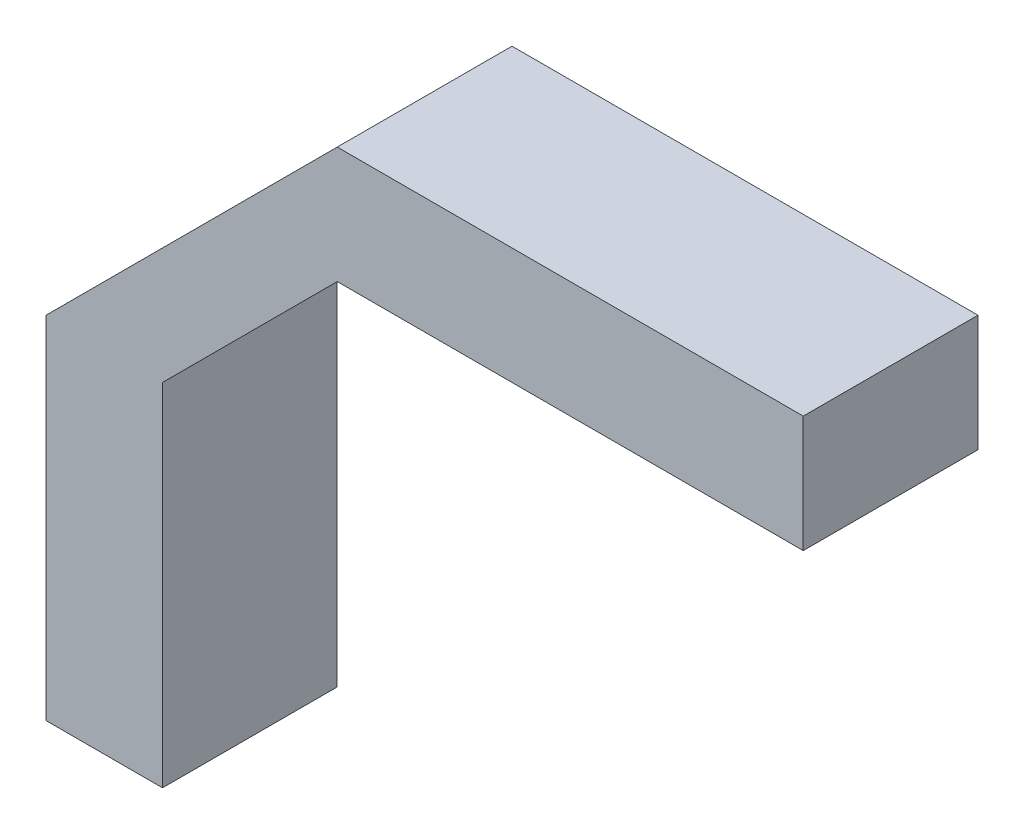
ISO-10303-21;
HEADER;
FILE_DESCRIPTION(('STEP AP214'),'2;1');
FILE_NAME('part.step','',(''),(''),'','','');
FILE_SCHEMA(('AUTOMOTIVE_DESIGN { 1 0 10303 214 1 1 1 1 }'));
ENDSEC;
DATA;
#1=APPLICATION_CONTEXT('core data for automotive mechanical design processes');
#2=APPLICATION_PROTOCOL_DEFINITION('international standard','automotive_design',2000,#1);
#3=PRODUCT_CONTEXT('',#1,'mechanical');
#4=PRODUCT('Part','Part','',(#3));
#5=PRODUCT_RELATED_PRODUCT_CATEGORY('part','',(#4));
#6=PRODUCT_DEFINITION_FORMATION('','',#4);
#7=PRODUCT_DEFINITION_CONTEXT('part definition',#1,'design');
#8=PRODUCT_DEFINITION('design','',#6,#7);
#9=PRODUCT_DEFINITION_SHAPE('','',#8);
#10=(LENGTH_UNIT() NAMED_UNIT(*) SI_UNIT(.MILLI.,.METRE.));
#11=(NAMED_UNIT(*) PLANE_ANGLE_UNIT() SI_UNIT($,.RADIAN.));
#12=(NAMED_UNIT(*) SI_UNIT($,.STERADIAN.) SOLID_ANGLE_UNIT());
#13=UNCERTAINTY_MEASURE_WITH_UNIT(LENGTH_MEASURE(1.E-05),#10,'distance_accuracy_value','');
#14=(GEOMETRIC_REPRESENTATION_CONTEXT(3) GLOBAL_UNCERTAINTY_ASSIGNED_CONTEXT((#13)) GLOBAL_UNIT_ASSIGNED_CONTEXT((#10,
#11,#12)) REPRESENTATION_CONTEXT('',''));
#15=CARTESIAN_POINT('',(0.,0.,0.));
#16=DIRECTION('',(0.,0.,1.));
#17=DIRECTION('',(1.,0.,0.));
#18=AXIS2_PLACEMENT_3D('',#15,#16,#17);
#19=CARTESIAN_POINT('',(0.,0.,7.5));
#20=DIRECTION('',(1.,0.,0.));
#21=DIRECTION('',(0.,1.,0.));
#22=AXIS2_PLACEMENT_3D('',#19,#20,#21);
#23=PLANE('',#22);
#24=DIRECTION('',(0.,-1.,0.));
#25=VECTOR('',#24,1.);
#26=CARTESIAN_POINT('',(0.,0.,-7.5));
#27=LINE('',#26,#25);
#28=CARTESIAN_POINT('',(0.,30.1334651507662,-7.5));
#29=VERTEX_POINT('',#28);
#30=CARTESIAN_POINT('',(0.,0.,-7.5));
#31=VERTEX_POINT('',#30);
#32=EDGE_CURVE('E128',#29,#31,#27,.T.);
#33=ORIENTED_EDGE('',*,*,#32,.T.);
#34=DIRECTION('',(0.,0.,-1.));
#35=VECTOR('',#34,1.);
#36=CARTESIAN_POINT('',(0.,0.,7.5));
#37=LINE('',#36,#35);
#38=CARTESIAN_POINT('',(0.,0.,7.5));
#39=VERTEX_POINT('',#38);
#40=EDGE_CURVE('E11',#39,#31,#37,.T.);
#41=ORIENTED_EDGE('',*,*,#40,.F.);
#42=DIRECTION('',(0.,-1.,0.));
#43=VECTOR('',#42,1.);
#44=CARTESIAN_POINT('',(0.,0.,7.5));
#45=LINE('',#44,#43);
#46=CARTESIAN_POINT('',(0.,30.1334651507662,7.5));
#47=VERTEX_POINT('',#46);
#48=EDGE_CURVE('E142',#47,#39,#45,.T.);
#49=ORIENTED_EDGE('',*,*,#48,.F.);
#50=DIRECTION('',(0.,0.,-1.));
#51=VECTOR('',#50,1.);
#52=CARTESIAN_POINT('',(0.,30.1334651507662,7.5));
#53=LINE('',#52,#51);
#54=EDGE_CURVE('E124',#47,#29,#53,.T.);
#55=ORIENTED_EDGE('',*,*,#54,.T.);
#56=EDGE_LOOP('',(#33,#41,#49,#55));
#57=FACE_BOUND('',#56,.T.);
#58=ADVANCED_FACE('F32',(#57),#23,.F.);
#59=CARTESIAN_POINT('',(0.,0.,7.5));
#60=DIRECTION('',(0.,1.,0.));
#61=DIRECTION('',(0.,0.,1.));
#62=AXIS2_PLACEMENT_3D('',#59,#60,#61);
#63=PLANE('',#62);
#64=DIRECTION('',(1.,0.,0.));
#65=VECTOR('',#64,1.);
#66=CARTESIAN_POINT('',(0.,0.,-7.5));
#67=LINE('',#66,#65);
#68=CARTESIAN_POINT('',(10.,0.,-7.5));
#69=VERTEX_POINT('',#68);
#70=EDGE_CURVE('E131',#31,#69,#67,.T.);
#71=ORIENTED_EDGE('',*,*,#70,.T.);
#72=DIRECTION('',(0.,0.,-1.));
#73=VECTOR('',#72,1.);
#74=CARTESIAN_POINT('',(10.,0.,7.5));
#75=LINE('',#74,#73);
#76=CARTESIAN_POINT('',(10.,0.,7.5));
#77=VERTEX_POINT('',#76);
#78=EDGE_CURVE('E40',#77,#69,#75,.T.);
#79=ORIENTED_EDGE('',*,*,#78,.F.);
#80=DIRECTION('',(1.,0.,0.));
#81=VECTOR('',#80,1.);
#82=CARTESIAN_POINT('',(0.,0.,7.5));
#83=LINE('',#82,#81);
#84=EDGE_CURVE('E91',#39,#77,#83,.T.);
#85=ORIENTED_EDGE('',*,*,#84,.F.);
#86=ORIENTED_EDGE('',*,*,#40,.T.);
#87=EDGE_LOOP('',(#71,#79,#85,#86));
#88=FACE_BOUND('',#87,.T.);
#89=ADVANCED_FACE('F177',(#88),#63,.F.);
#90=CARTESIAN_POINT('',(10.,0.,7.5));
#91=DIRECTION('',(-1.,0.,0.));
#92=DIRECTION('',(0.,0.,1.));
#93=AXIS2_PLACEMENT_3D('',#90,#91,#92);
#94=PLANE('',#93);
#95=DIRECTION('',(0.,1.,0.));
#96=VECTOR('',#95,1.);
#97=CARTESIAN_POINT('',(10.,0.,-7.5));
#98=LINE('',#97,#96);
#99=CARTESIAN_POINT('',(10.,30.1334651507662,-7.5));
#100=VERTEX_POINT('',#99);
#101=EDGE_CURVE('E133',#69,#100,#98,.T.);
#102=ORIENTED_EDGE('',*,*,#101,.T.);
#103=DIRECTION('',(0.,0.,-1.));
#104=VECTOR('',#103,1.);
#105=CARTESIAN_POINT('',(10.,30.1334651507662,7.5));
#106=LINE('',#105,#104);
#107=CARTESIAN_POINT('',(10.,30.1334651507662,7.5));
#108=VERTEX_POINT('',#107);
#109=EDGE_CURVE('E149',#108,#100,#106,.T.);
#110=ORIENTED_EDGE('',*,*,#109,.F.);
#111=DIRECTION('',(0.,1.,0.));
#112=VECTOR('',#111,1.);
#113=CARTESIAN_POINT('',(10.,0.,7.5));
#114=LINE('',#113,#112);
#115=EDGE_CURVE('E157',#77,#108,#114,.T.);
#116=ORIENTED_EDGE('',*,*,#115,.F.);
#117=ORIENTED_EDGE('',*,*,#78,.T.);
#118=EDGE_LOOP('',(#102,#110,#116,#117));
#119=FACE_BOUND('',#118,.T.);
#120=ADVANCED_FACE('F155',(#119),#94,.F.);
#121=CARTESIAN_POINT('',(10.,30.1334651507662,7.5));
#122=DIRECTION('',(-0.707106781186547,0.707106781186548,0.));
#123=DIRECTION('',(-0.707106781186548,-0.707106781186547,0.));
#124=AXIS2_PLACEMENT_3D('',#121,#122,#123);
#125=PLANE('',#124);
#126=DIRECTION('',(0.707106781186548,0.707106781186547,0.));
#127=VECTOR('',#126,1.);
#128=CARTESIAN_POINT('',(10.,30.1334651507662,-7.5));
#129=LINE('',#128,#127);
#130=CARTESIAN_POINT('',(25.,45.1334651507662,-7.5));
#131=VERTEX_POINT('',#130);
#132=EDGE_CURVE('E135',#100,#131,#129,.T.);
#133=ORIENTED_EDGE('',*,*,#132,.T.);
#134=DIRECTION('',(0.,0.,-1.));
#135=VECTOR('',#134,1.);
#136=CARTESIAN_POINT('',(25.,45.1334651507662,7.5));
#137=LINE('',#136,#135);
#138=CARTESIAN_POINT('',(25.,45.1334651507662,7.5));
#139=VERTEX_POINT('',#138);
#140=EDGE_CURVE('E146',#139,#131,#137,.T.);
#141=ORIENTED_EDGE('',*,*,#140,.F.);
#142=DIRECTION('',(0.707106781186548,0.707106781186547,0.));
#143=VECTOR('',#142,1.);
#144=CARTESIAN_POINT('',(10.,30.1334651507662,7.5));
#145=LINE('',#144,#143);
#146=EDGE_CURVE('E169',#108,#139,#145,.T.);
#147=ORIENTED_EDGE('',*,*,#146,.F.);
#148=ORIENTED_EDGE('',*,*,#109,.T.);
#149=EDGE_LOOP('',(#133,#141,#147,#148));
#150=FACE_BOUND('',#149,.T.);
#151=ADVANCED_FACE('F165',(#150),#125,.F.);
#152=CARTESIAN_POINT('',(25.,45.1334651507662,7.5));
#153=DIRECTION('',(0.,1.,0.));
#154=DIRECTION('',(-1.,0.,0.));
#155=AXIS2_PLACEMENT_3D('',#152,#153,#154);
#156=PLANE('',#155);
#157=DIRECTION('',(1.,0.,0.));
#158=VECTOR('',#157,1.);
#159=CARTESIAN_POINT('',(25.,45.1334651507662,-7.5));
#160=LINE('',#159,#158);
#161=CARTESIAN_POINT('',(65.0000000000006,45.1334651507662,-7.5));
#162=VERTEX_POINT('',#161);
#163=EDGE_CURVE('E137',#131,#162,#160,.T.);
#164=ORIENTED_EDGE('',*,*,#163,.T.);
#165=DIRECTION('',(0.,0.,-1.));
#166=VECTOR('',#165,1.);
#167=CARTESIAN_POINT('',(65.0000000000006,45.1334651507662,7.5));
#168=LINE('',#167,#166);
#169=CARTESIAN_POINT('',(65.0000000000006,45.1334651507662,7.5));
#170=VERTEX_POINT('',#169);
#171=EDGE_CURVE('E119',#170,#162,#168,.T.);
#172=ORIENTED_EDGE('',*,*,#171,.F.);
#173=DIRECTION('',(1.,0.,0.));
#174=VECTOR('',#173,1.);
#175=CARTESIAN_POINT('',(25.,45.1334651507662,7.5));
#176=LINE('',#175,#174);
#177=EDGE_CURVE('E110',#139,#170,#176,.T.);
#178=ORIENTED_EDGE('',*,*,#177,.F.);
#179=ORIENTED_EDGE('',*,*,#140,.T.);
#180=EDGE_LOOP('',(#164,#172,#178,#179));
#181=FACE_BOUND('',#180,.T.);
#182=ADVANCED_FACE('F168',(#181),#156,.F.);
#183=CARTESIAN_POINT('',(65.0000000000006,55.1334651507662,7.5));
#184=DIRECTION('',(-1.,0.,0.));
#185=DIRECTION('',(0.,0.,1.));
#186=AXIS2_PLACEMENT_3D('',#183,#184,#185);
#187=PLANE('',#186);
#188=DIRECTION('',(0.,1.,0.));
#189=VECTOR('',#188,1.);
#190=CARTESIAN_POINT('',(65.0000000000006,55.1334651507662,-7.5));
#191=LINE('',#190,#189);
#192=CARTESIAN_POINT('',(65.0000000000006,55.1334651507662,-7.5));
#193=VERTEX_POINT('',#192);
#194=EDGE_CURVE('E118',#162,#193,#191,.T.);
#195=ORIENTED_EDGE('',*,*,#194,.T.);
#196=DIRECTION('',(0.,0.,-1.));
#197=VECTOR('',#196,1.);
#198=CARTESIAN_POINT('',(65.0000000000006,55.1334651507662,7.5));
#199=LINE('',#198,#197);
#200=CARTESIAN_POINT('',(65.0000000000006,55.1334651507662,7.5));
#201=VERTEX_POINT('',#200);
#202=EDGE_CURVE('E115',#201,#193,#199,.T.);
#203=ORIENTED_EDGE('',*,*,#202,.F.);
#204=DIRECTION('',(0.,1.,0.));
#205=VECTOR('',#204,1.);
#206=CARTESIAN_POINT('',(65.0000000000006,55.1334651507662,7.5));
#207=LINE('',#206,#205);
#208=EDGE_CURVE('E104',#170,#201,#207,.T.);
#209=ORIENTED_EDGE('',*,*,#208,.F.);
#210=ORIENTED_EDGE('',*,*,#171,.T.);
#211=EDGE_LOOP('',(#195,#203,#209,#210));
#212=FACE_BOUND('',#211,.T.);
#213=ADVANCED_FACE('F116',(#212),#187,.F.);
#214=CARTESIAN_POINT('',(65.0000000000006,55.1334651507662,7.5));
#215=DIRECTION('',(0.,-1.,0.));
#216=DIRECTION('',(1.,0.,0.));
#217=AXIS2_PLACEMENT_3D('',#214,#215,#216);
#218=PLANE('',#217);
#219=DIRECTION('',(-1.,0.,0.));
#220=VECTOR('',#219,1.);
#221=CARTESIAN_POINT('',(65.0000000000006,55.1334651507662,-7.5));
#222=LINE('',#221,#220);
#223=CARTESIAN_POINT('',(25.,55.1334651507662,-7.5));
#224=VERTEX_POINT('',#223);
#225=EDGE_CURVE('E77',#193,#224,#222,.T.);
#226=ORIENTED_EDGE('',*,*,#225,.T.);
#227=DIRECTION('',(0.,0.,-1.));
#228=VECTOR('',#227,1.);
#229=CARTESIAN_POINT('',(25.,55.1334651507662,7.5));
#230=LINE('',#229,#228);
#231=CARTESIAN_POINT('',(25.,55.1334651507662,7.5));
#232=VERTEX_POINT('',#231);
#233=EDGE_CURVE('E120',#232,#224,#230,.T.);
#234=ORIENTED_EDGE('',*,*,#233,.F.);
#235=DIRECTION('',(-1.,0.,0.));
#236=VECTOR('',#235,1.);
#237=CARTESIAN_POINT('',(65.0000000000006,55.1334651507662,7.5));
#238=LINE('',#237,#236);
#239=EDGE_CURVE('E108',#201,#232,#238,.T.);
#240=ORIENTED_EDGE('',*,*,#239,.F.);
#241=ORIENTED_EDGE('',*,*,#202,.T.);
#242=EDGE_LOOP('',(#226,#234,#240,#241));
#243=FACE_BOUND('',#242,.T.);
#244=ADVANCED_FACE('F122',(#243),#218,.F.);
#245=CARTESIAN_POINT('',(0.,30.1334651507662,7.5));
#246=DIRECTION('',(0.707106781186547,-0.707106781186547,0.));
#247=DIRECTION('',(0.707106781186548,0.707106781186548,0.));
#248=AXIS2_PLACEMENT_3D('',#245,#246,#247);
#249=PLANE('',#248);
#250=DIRECTION('',(-0.707106781186547,-0.707106781186547,0.));
#251=VECTOR('',#250,1.);
#252=CARTESIAN_POINT('',(0.,30.1334651507662,-7.5));
#253=LINE('',#252,#251);
#254=EDGE_CURVE('E83',#224,#29,#253,.T.);
#255=ORIENTED_EDGE('',*,*,#254,.T.);
#256=ORIENTED_EDGE('',*,*,#54,.F.);
#257=DIRECTION('',(-0.707106781186547,-0.707106781186547,0.));
#258=VECTOR('',#257,1.);
#259=CARTESIAN_POINT('',(0.,30.1334651507662,7.5));
#260=LINE('',#259,#258);
#261=EDGE_CURVE('E48',#232,#47,#260,.T.);
#262=ORIENTED_EDGE('',*,*,#261,.F.);
#263=ORIENTED_EDGE('',*,*,#233,.T.);
#264=EDGE_LOOP('',(#255,#256,#262,#263));
#265=FACE_BOUND('',#264,.T.);
#266=ADVANCED_FACE('F193',(#265),#249,.F.);
#267=CARTESIAN_POINT('',(0.,0.,7.5));
#268=DIRECTION('',(0.,0.,1.));
#269=DIRECTION('',(1.,0.,0.));
#270=AXIS2_PLACEMENT_3D('',#267,#268,#269);
#271=PLANE('',#270);
#272=ORIENTED_EDGE('',*,*,#48,.T.);
#273=ORIENTED_EDGE('',*,*,#84,.T.);
#274=ORIENTED_EDGE('',*,*,#115,.T.);
#275=ORIENTED_EDGE('',*,*,#146,.T.);
#276=ORIENTED_EDGE('',*,*,#177,.T.);
#277=ORIENTED_EDGE('',*,*,#208,.T.);
#278=ORIENTED_EDGE('',*,*,#239,.T.);
#279=ORIENTED_EDGE('',*,*,#261,.T.);
#280=EDGE_LOOP('',(#272,#273,#274,#275,#276,#277,#278,#279));
#281=FACE_BOUND('',#280,.T.);
#282=ADVANCED_FACE('F106',(#281),#271,.T.);
#283=CARTESIAN_POINT('',(0.,0.,-7.5));
#284=DIRECTION('',(0.,0.,1.));
#285=DIRECTION('',(1.,0.,0.));
#286=AXIS2_PLACEMENT_3D('',#283,#284,#285);
#287=PLANE('',#286);
#288=ORIENTED_EDGE('',*,*,#32,.F.);
#289=ORIENTED_EDGE('',*,*,#254,.F.);
#290=ORIENTED_EDGE('',*,*,#225,.F.);
#291=ORIENTED_EDGE('',*,*,#194,.F.);
#292=ORIENTED_EDGE('',*,*,#163,.F.);
#293=ORIENTED_EDGE('',*,*,#132,.F.);
#294=ORIENTED_EDGE('',*,*,#101,.F.);
#295=ORIENTED_EDGE('',*,*,#70,.F.);
#296=EDGE_LOOP('',(#288,#289,#290,#291,#292,#293,#294,#295));
#297=FACE_BOUND('',#296,.T.);
#298=ADVANCED_FACE('F161',(#297),#287,.F.);
#299=CLOSED_SHELL('',(#58,#89,#120,#151,#182,#213,#244,#266,#282,#298));
#300=MANIFOLD_SOLID_BREP('B2',#299);
#301=ADVANCED_BREP_SHAPE_REPRESENTATION('',(#18,#300),#14);
#302=SHAPE_DEFINITION_REPRESENTATION(#9,#301);
ENDSEC;
END-ISO-10303-21;
